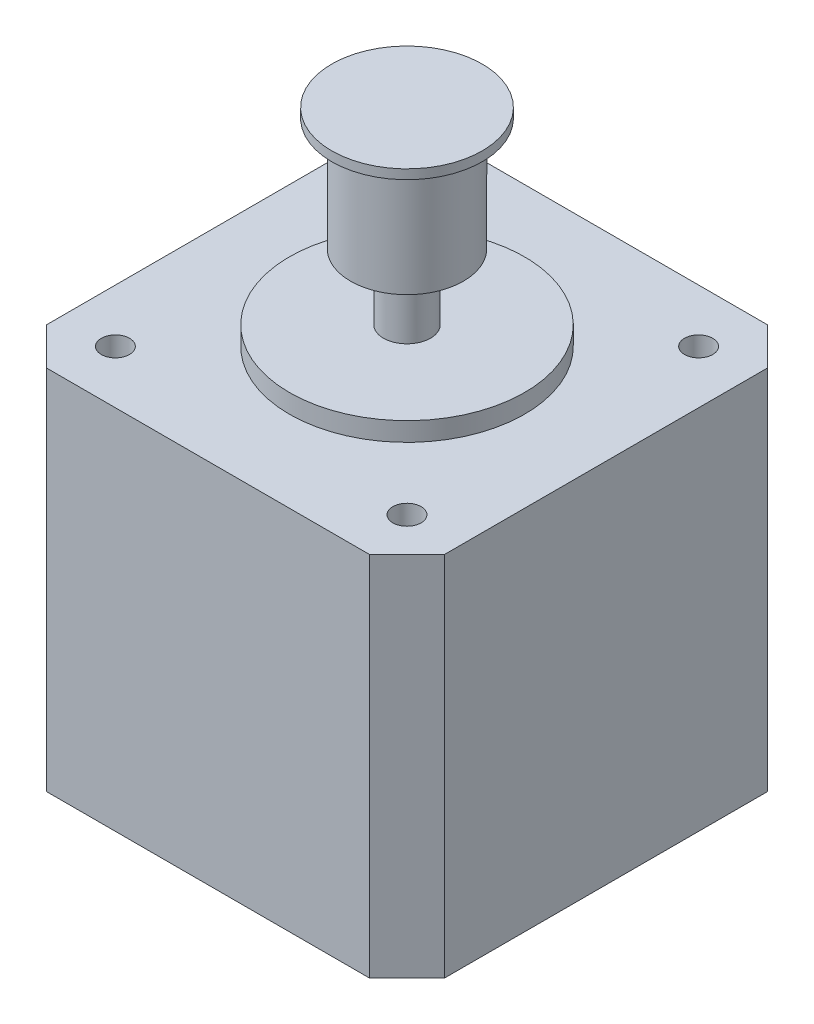
ISO-10303-21;
HEADER;
FILE_DESCRIPTION(('STEP AP214'),'2;1');
FILE_NAME('part.step','',(''),(''),'','','');
FILE_SCHEMA(('AUTOMOTIVE_DESIGN { 1 0 10303 214 1 1 1 1 }'));
ENDSEC;
DATA;
#1=APPLICATION_CONTEXT('core data for automotive mechanical design processes');
#2=APPLICATION_PROTOCOL_DEFINITION('international standard','automotive_design',2000,#1);
#3=PRODUCT_CONTEXT('',#1,'mechanical');
#4=PRODUCT('Part','Part','',(#3));
#5=PRODUCT_RELATED_PRODUCT_CATEGORY('part','',(#4));
#6=PRODUCT_DEFINITION_FORMATION('','',#4);
#7=PRODUCT_DEFINITION_CONTEXT('part definition',#1,'design');
#8=PRODUCT_DEFINITION('design','',#6,#7);
#9=PRODUCT_DEFINITION_SHAPE('','',#8);
#10=(LENGTH_UNIT() NAMED_UNIT(*) SI_UNIT(.MILLI.,.METRE.));
#11=(NAMED_UNIT(*) PLANE_ANGLE_UNIT() SI_UNIT($,.RADIAN.));
#12=(NAMED_UNIT(*) SI_UNIT($,.STERADIAN.) SOLID_ANGLE_UNIT());
#13=UNCERTAINTY_MEASURE_WITH_UNIT(LENGTH_MEASURE(1.E-05),#10,'distance_accuracy_value','');
#14=(GEOMETRIC_REPRESENTATION_CONTEXT(3) GLOBAL_UNCERTAINTY_ASSIGNED_CONTEXT((#13)) GLOBAL_UNIT_ASSIGNED_CONTEXT((#10,
#11,#12)) REPRESENTATION_CONTEXT('',''));
#15=CARTESIAN_POINT('',(0.,0.,0.));
#16=DIRECTION('',(0.,0.,1.));
#17=DIRECTION('',(1.,0.,0.));
#18=AXIS2_PLACEMENT_3D('',#15,#16,#17);
#19=CARTESIAN_POINT('',(0.,41.5,0.));
#20=DIRECTION('',(0.,-1.,0.));
#21=DIRECTION('',(0.,0.,-1.));
#22=AXIS2_PLACEMENT_3D('',#19,#20,#21);
#23=CYLINDRICAL_SURFACE('',#22,2.5);
#24=CARTESIAN_POINT('',(0.,28.5,0.));
#25=DIRECTION('',(0.,-1.,0.));
#26=DIRECTION('',(0.,0.,-1.));
#27=AXIS2_PLACEMENT_3D('',#24,#25,#26);
#28=CIRCLE('',#27,2.5);
#29=CARTESIAN_POINT('',(0.,28.5,-2.5));
#30=VERTEX_POINT('',#29);
#31=EDGE_CURVE('E141',#30,#30,#28,.T.);
#32=ORIENTED_EDGE('',*,*,#31,.T.);
#33=EDGE_LOOP('',(#32));
#34=FACE_BOUND('',#33,.T.);
#35=CARTESIAN_POINT('',(0.,21.5,0.));
#36=DIRECTION('',(0.,1.,0.));
#37=DIRECTION('',(0.,0.,1.));
#38=AXIS2_PLACEMENT_3D('',#35,#36,#37);
#39=CIRCLE('',#38,2.5);
#40=CARTESIAN_POINT('',(0.,21.5,2.5));
#41=VERTEX_POINT('',#40);
#42=EDGE_CURVE('E140',#41,#41,#39,.T.);
#43=ORIENTED_EDGE('',*,*,#42,.T.);
#44=EDGE_LOOP('',(#43));
#45=FACE_BOUND('',#44,.T.);
#46=ADVANCED_FACE('F36',(#34,#45),#23,.T.);
#47=CARTESIAN_POINT('',(0.,19.5,0.));
#48=DIRECTION('',(0.,1.,0.));
#49=DIRECTION('',(0.,0.,1.));
#50=AXIS2_PLACEMENT_3D('',#47,#48,#49);
#51=PLANE('',#50);
#52=CARTESIAN_POINT('',(0.,19.5,0.));
#53=DIRECTION('',(0.,1.,0.));
#54=DIRECTION('',(0.,0.,1.));
#55=AXIS2_PLACEMENT_3D('',#52,#53,#54);
#56=CIRCLE('',#55,12.5);
#57=CARTESIAN_POINT('',(0.,19.5,12.5));
#58=VERTEX_POINT('',#57);
#59=EDGE_CURVE('E204',#58,#58,#56,.T.);
#60=ORIENTED_EDGE('',*,*,#59,.F.);
#61=EDGE_LOOP('',(#60));
#62=FACE_BOUND('',#61,.T.);
#63=CARTESIAN_POINT('',(-15.5,19.5,15.5));
#64=DIRECTION('',(0.,1.,0.));
#65=DIRECTION('',(0.,0.,1.));
#66=AXIS2_PLACEMENT_3D('',#63,#64,#65);
#67=CIRCLE('',#66,1.5);
#68=CARTESIAN_POINT('',(-15.5,19.5,17.));
#69=VERTEX_POINT('',#68);
#70=EDGE_CURVE('E189',#69,#69,#67,.T.);
#71=ORIENTED_EDGE('',*,*,#70,.F.);
#72=EDGE_LOOP('',(#71));
#73=FACE_BOUND('',#72,.T.);
#74=CARTESIAN_POINT('',(15.5,19.5,-15.5));
#75=DIRECTION('',(0.,1.,0.));
#76=DIRECTION('',(0.,0.,1.));
#77=AXIS2_PLACEMENT_3D('',#74,#75,#76);
#78=CIRCLE('',#77,1.5);
#79=CARTESIAN_POINT('',(15.5,19.5,-14.));
#80=VERTEX_POINT('',#79);
#81=EDGE_CURVE('E172',#80,#80,#78,.T.);
#82=ORIENTED_EDGE('',*,*,#81,.F.);
#83=EDGE_LOOP('',(#82));
#84=FACE_BOUND('',#83,.T.);
#85=DIRECTION('',(0.,0.,1.));
#86=VECTOR('',#85,1.);
#87=CARTESIAN_POINT('',(-21.15,19.5,-21.15));
#88=LINE('',#87,#86);
#89=CARTESIAN_POINT('',(-21.15,19.5,-17.15));
#90=VERTEX_POINT('',#89);
#91=CARTESIAN_POINT('',(-21.15,19.5,17.15));
#92=VERTEX_POINT('',#91);
#93=EDGE_CURVE('E176',#90,#92,#88,.T.);
#94=ORIENTED_EDGE('',*,*,#93,.T.);
#95=DIRECTION('',(-0.707106781186546,0.,-0.707106781186549));
#96=VECTOR('',#95,1.);
#97=CARTESIAN_POINT('',(-19.15,19.5,19.15));
#98=LINE('',#97,#96);
#99=CARTESIAN_POINT('',(-17.15,19.5,21.15));
#100=VERTEX_POINT('',#99);
#101=EDGE_CURVE('E159',#92,#100,#98,.F.);
#102=ORIENTED_EDGE('',*,*,#101,.T.);
#103=DIRECTION('',(1.,0.,0.));
#104=VECTOR('',#103,1.);
#105=CARTESIAN_POINT('',(-21.15,19.5,21.15));
#106=LINE('',#105,#104);
#107=CARTESIAN_POINT('',(17.15,19.5,21.15));
#108=VERTEX_POINT('',#107);
#109=EDGE_CURVE('E121',#100,#108,#106,.T.);
#110=ORIENTED_EDGE('',*,*,#109,.T.);
#111=DIRECTION('',(-0.707106781186549,0.,0.707106781186546));
#112=VECTOR('',#111,1.);
#113=CARTESIAN_POINT('',(19.15,19.5,19.15));
#114=LINE('',#113,#112);
#115=CARTESIAN_POINT('',(21.15,19.5,17.15));
#116=VERTEX_POINT('',#115);
#117=EDGE_CURVE('E157',#108,#116,#114,.F.);
#118=ORIENTED_EDGE('',*,*,#117,.T.);
#119=DIRECTION('',(0.,0.,-1.));
#120=VECTOR('',#119,1.);
#121=CARTESIAN_POINT('',(21.15,19.5,-21.15));
#122=LINE('',#121,#120);
#123=CARTESIAN_POINT('',(21.15,19.5,-17.15));
#124=VERTEX_POINT('',#123);
#125=EDGE_CURVE('E128',#116,#124,#122,.T.);
#126=ORIENTED_EDGE('',*,*,#125,.T.);
#127=DIRECTION('',(0.707106781186546,0.,0.707106781186549));
#128=VECTOR('',#127,1.);
#129=CARTESIAN_POINT('',(19.15,19.5,-19.15));
#130=LINE('',#129,#128);
#131=CARTESIAN_POINT('',(17.15,19.5,-21.15));
#132=VERTEX_POINT('',#131);
#133=EDGE_CURVE('E56',#124,#132,#130,.F.);
#134=ORIENTED_EDGE('',*,*,#133,.T.);
#135=DIRECTION('',(-1.,0.,0.));
#136=VECTOR('',#135,1.);
#137=CARTESIAN_POINT('',(-21.15,19.5,-21.15));
#138=LINE('',#137,#136);
#139=CARTESIAN_POINT('',(-17.15,19.5,-21.15));
#140=VERTEX_POINT('',#139);
#141=EDGE_CURVE('E131',#132,#140,#138,.T.);
#142=ORIENTED_EDGE('',*,*,#141,.T.);
#143=DIRECTION('',(0.707106781186549,0.,-0.707106781186546));
#144=VECTOR('',#143,1.);
#145=CARTESIAN_POINT('',(-19.15,19.5,-19.15));
#146=LINE('',#145,#144);
#147=EDGE_CURVE('E155',#140,#90,#146,.F.);
#148=ORIENTED_EDGE('',*,*,#147,.T.);
#149=EDGE_LOOP('',(#94,#102,#110,#118,#126,#134,#142,#148));
#150=FACE_BOUND('',#149,.T.);
#151=CARTESIAN_POINT('',(15.5,19.5,15.5));
#152=DIRECTION('',(0.,1.,0.));
#153=DIRECTION('',(0.,0.,-1.));
#154=AXIS2_PLACEMENT_3D('',#151,#152,#153);
#155=CIRCLE('',#154,1.5);
#156=CARTESIAN_POINT('',(15.5,19.5,14.));
#157=VERTEX_POINT('',#156);
#158=EDGE_CURVE('E183',#157,#157,#155,.T.);
#159=ORIENTED_EDGE('',*,*,#158,.F.);
#160=EDGE_LOOP('',(#159));
#161=FACE_BOUND('',#160,.T.);
#162=CARTESIAN_POINT('',(-15.5,19.5,-15.5));
#163=DIRECTION('',(0.,1.,0.));
#164=DIRECTION('',(0.,0.,-1.));
#165=AXIS2_PLACEMENT_3D('',#162,#163,#164);
#166=CIRCLE('',#165,1.5);
#167=CARTESIAN_POINT('',(-15.5,19.5,-17.));
#168=VERTEX_POINT('',#167);
#169=EDGE_CURVE('E195',#168,#168,#166,.T.);
#170=ORIENTED_EDGE('',*,*,#169,.F.);
#171=EDGE_LOOP('',(#170));
#172=FACE_BOUND('',#171,.T.);
#173=ADVANCED_FACE('F250',(#62,#73,#84,#150,#161,#172),#51,.T.);
#174=CARTESIAN_POINT('',(0.,-19.5,0.));
#175=DIRECTION('',(0.,1.,0.));
#176=DIRECTION('',(0.,0.,1.));
#177=AXIS2_PLACEMENT_3D('',#174,#175,#176);
#178=PLANE('',#177);
#179=DIRECTION('',(1.,0.,0.));
#180=VECTOR('',#179,1.);
#181=CARTESIAN_POINT('',(-21.15,-19.5,21.15));
#182=LINE('',#181,#180);
#183=CARTESIAN_POINT('',(-17.15,-19.5,21.15));
#184=VERTEX_POINT('',#183);
#185=CARTESIAN_POINT('',(17.15,-19.5,21.15));
#186=VERTEX_POINT('',#185);
#187=EDGE_CURVE('E118',#184,#186,#182,.T.);
#188=ORIENTED_EDGE('',*,*,#187,.F.);
#189=DIRECTION('',(0.707106781186546,0.,0.707106781186549));
#190=VECTOR('',#189,1.);
#191=CARTESIAN_POINT('',(-17.15,-19.5,21.15));
#192=LINE('',#191,#190);
#193=CARTESIAN_POINT('',(-21.15,-19.5,17.15));
#194=VERTEX_POINT('',#193);
#195=EDGE_CURVE('E101',#184,#194,#192,.F.);
#196=ORIENTED_EDGE('',*,*,#195,.T.);
#197=DIRECTION('',(0.,0.,1.));
#198=VECTOR('',#197,1.);
#199=CARTESIAN_POINT('',(-21.15,-19.5,-21.15));
#200=LINE('',#199,#198);
#201=CARTESIAN_POINT('',(-21.15,-19.5,-17.15));
#202=VERTEX_POINT('',#201);
#203=EDGE_CURVE('E129',#202,#194,#200,.T.);
#204=ORIENTED_EDGE('',*,*,#203,.F.);
#205=DIRECTION('',(-0.707106781186549,0.,0.707106781186546));
#206=VECTOR('',#205,1.);
#207=CARTESIAN_POINT('',(-21.15,-19.5,-17.15));
#208=LINE('',#207,#206);
#209=CARTESIAN_POINT('',(-17.15,-19.5,-21.15));
#210=VERTEX_POINT('',#209);
#211=EDGE_CURVE('E148',#202,#210,#208,.F.);
#212=ORIENTED_EDGE('',*,*,#211,.T.);
#213=DIRECTION('',(-1.,0.,0.));
#214=VECTOR('',#213,1.);
#215=CARTESIAN_POINT('',(-21.15,-19.5,-21.15));
#216=LINE('',#215,#214);
#217=CARTESIAN_POINT('',(17.15,-19.5,-21.15));
#218=VERTEX_POINT('',#217);
#219=EDGE_CURVE('E133',#218,#210,#216,.T.);
#220=ORIENTED_EDGE('',*,*,#219,.F.);
#221=DIRECTION('',(-0.707106781186546,0.,-0.707106781186549));
#222=VECTOR('',#221,1.);
#223=CARTESIAN_POINT('',(17.15,-19.5,-21.15));
#224=LINE('',#223,#222);
#225=CARTESIAN_POINT('',(21.15,-19.5,-17.15));
#226=VERTEX_POINT('',#225);
#227=EDGE_CURVE('E122',#218,#226,#224,.F.);
#228=ORIENTED_EDGE('',*,*,#227,.T.);
#229=DIRECTION('',(0.,0.,-1.));
#230=VECTOR('',#229,1.);
#231=CARTESIAN_POINT('',(21.15,-19.5,-21.15));
#232=LINE('',#231,#230);
#233=CARTESIAN_POINT('',(21.15,-19.5,17.15));
#234=VERTEX_POINT('',#233);
#235=EDGE_CURVE('E171',#234,#226,#232,.T.);
#236=ORIENTED_EDGE('',*,*,#235,.F.);
#237=DIRECTION('',(0.707106781186549,0.,-0.707106781186546));
#238=VECTOR('',#237,1.);
#239=CARTESIAN_POINT('',(21.15,-19.5,17.15));
#240=LINE('',#239,#238);
#241=EDGE_CURVE('E112',#234,#186,#240,.F.);
#242=ORIENTED_EDGE('',*,*,#241,.T.);
#243=EDGE_LOOP('',(#188,#196,#204,#212,#220,#228,#236,#242));
#244=FACE_BOUND('',#243,.T.);
#245=CARTESIAN_POINT('',(15.5,-19.5,-15.5));
#246=DIRECTION('',(0.,1.,0.));
#247=DIRECTION('',(0.,0.,1.));
#248=AXIS2_PLACEMENT_3D('',#245,#246,#247);
#249=CIRCLE('',#248,1.5);
#250=CARTESIAN_POINT('',(15.5,-19.5,-14.));
#251=VERTEX_POINT('',#250);
#252=EDGE_CURVE('E180',#251,#251,#249,.T.);
#253=ORIENTED_EDGE('',*,*,#252,.T.);
#254=EDGE_LOOP('',(#253));
#255=FACE_BOUND('',#254,.T.);
#256=CARTESIAN_POINT('',(15.5,-19.5,15.5));
#257=DIRECTION('',(0.,1.,0.));
#258=DIRECTION('',(0.,0.,-1.));
#259=AXIS2_PLACEMENT_3D('',#256,#257,#258);
#260=CIRCLE('',#259,1.5);
#261=CARTESIAN_POINT('',(15.5,-19.5,14.));
#262=VERTEX_POINT('',#261);
#263=EDGE_CURVE('E186',#262,#262,#260,.T.);
#264=ORIENTED_EDGE('',*,*,#263,.T.);
#265=EDGE_LOOP('',(#264));
#266=FACE_BOUND('',#265,.T.);
#267=CARTESIAN_POINT('',(-15.5,-19.5,15.5));
#268=DIRECTION('',(0.,1.,0.));
#269=DIRECTION('',(0.,0.,1.));
#270=AXIS2_PLACEMENT_3D('',#267,#268,#269);
#271=CIRCLE('',#270,1.5);
#272=CARTESIAN_POINT('',(-15.5,-19.5,17.));
#273=VERTEX_POINT('',#272);
#274=EDGE_CURVE('E192',#273,#273,#271,.T.);
#275=ORIENTED_EDGE('',*,*,#274,.T.);
#276=EDGE_LOOP('',(#275));
#277=FACE_BOUND('',#276,.T.);
#278=CARTESIAN_POINT('',(-15.5,-19.5,-15.5));
#279=DIRECTION('',(0.,1.,0.));
#280=DIRECTION('',(0.,0.,-1.));
#281=AXIS2_PLACEMENT_3D('',#278,#279,#280);
#282=CIRCLE('',#281,1.5);
#283=CARTESIAN_POINT('',(-15.5,-19.5,-17.));
#284=VERTEX_POINT('',#283);
#285=EDGE_CURVE('E198',#284,#284,#282,.T.);
#286=ORIENTED_EDGE('',*,*,#285,.T.);
#287=EDGE_LOOP('',(#286));
#288=FACE_BOUND('',#287,.T.);
#289=ADVANCED_FACE('F125',(#244,#255,#266,#277,#288),#178,.F.);
#290=CARTESIAN_POINT('',(21.15,19.5,-21.15));
#291=DIRECTION('',(-1.,0.,0.));
#292=DIRECTION('',(0.,0.,1.));
#293=AXIS2_PLACEMENT_3D('',#290,#291,#292);
#294=PLANE('',#293);
#295=ORIENTED_EDGE('',*,*,#125,.F.);
#296=DIRECTION('',(0.,-1.,0.));
#297=VECTOR('',#296,1.);
#298=CARTESIAN_POINT('',(21.15,19.5,17.15));
#299=LINE('',#298,#297);
#300=EDGE_CURVE('E163',#116,#234,#299,.T.);
#301=ORIENTED_EDGE('',*,*,#300,.T.);
#302=ORIENTED_EDGE('',*,*,#235,.T.);
#303=DIRECTION('',(0.,1.,0.));
#304=VECTOR('',#303,1.);
#305=CARTESIAN_POINT('',(21.15,19.5,-17.15));
#306=LINE('',#305,#304);
#307=EDGE_CURVE('E161',#226,#124,#306,.T.);
#308=ORIENTED_EDGE('',*,*,#307,.T.);
#309=EDGE_LOOP('',(#295,#301,#302,#308));
#310=FACE_BOUND('',#309,.T.);
#311=ADVANCED_FACE('F284',(#310),#294,.F.);
#312=CARTESIAN_POINT('',(-21.15,19.5,-21.15));
#313=DIRECTION('',(0.,0.,1.));
#314=DIRECTION('',(1.,0.,0.));
#315=AXIS2_PLACEMENT_3D('',#312,#313,#314);
#316=PLANE('',#315);
#317=ORIENTED_EDGE('',*,*,#219,.T.);
#318=DIRECTION('',(0.,1.,0.));
#319=VECTOR('',#318,1.);
#320=CARTESIAN_POINT('',(-17.15,19.5,-21.15));
#321=LINE('',#320,#319);
#322=EDGE_CURVE('E11',#210,#140,#321,.T.);
#323=ORIENTED_EDGE('',*,*,#322,.T.);
#324=ORIENTED_EDGE('',*,*,#141,.F.);
#325=DIRECTION('',(0.,-1.,0.));
#326=VECTOR('',#325,1.);
#327=CARTESIAN_POINT('',(17.15,19.5,-21.15));
#328=LINE('',#327,#326);
#329=EDGE_CURVE('E44',#132,#218,#328,.T.);
#330=ORIENTED_EDGE('',*,*,#329,.T.);
#331=EDGE_LOOP('',(#317,#323,#324,#330));
#332=FACE_BOUND('',#331,.T.);
#333=ADVANCED_FACE('F168',(#332),#316,.F.);
#334=CARTESIAN_POINT('',(-21.15,19.5,-21.15));
#335=DIRECTION('',(1.,0.,0.));
#336=DIRECTION('',(0.,0.,-1.));
#337=AXIS2_PLACEMENT_3D('',#334,#335,#336);
#338=PLANE('',#337);
#339=ORIENTED_EDGE('',*,*,#203,.T.);
#340=DIRECTION('',(0.,1.,0.));
#341=VECTOR('',#340,1.);
#342=CARTESIAN_POINT('',(-21.15,19.5,17.15));
#343=LINE('',#342,#341);
#344=EDGE_CURVE('E106',#194,#92,#343,.T.);
#345=ORIENTED_EDGE('',*,*,#344,.T.);
#346=ORIENTED_EDGE('',*,*,#93,.F.);
#347=DIRECTION('',(0.,-1.,0.));
#348=VECTOR('',#347,1.);
#349=CARTESIAN_POINT('',(-21.15,19.5,-17.15));
#350=LINE('',#349,#348);
#351=EDGE_CURVE('E111',#90,#202,#350,.T.);
#352=ORIENTED_EDGE('',*,*,#351,.T.);
#353=EDGE_LOOP('',(#339,#345,#346,#352));
#354=FACE_BOUND('',#353,.T.);
#355=ADVANCED_FACE('F287',(#354),#338,.F.);
#356=CARTESIAN_POINT('',(-21.15,19.5,21.15));
#357=DIRECTION('',(0.,0.,-1.));
#358=DIRECTION('',(-1.,0.,0.));
#359=AXIS2_PLACEMENT_3D('',#356,#357,#358);
#360=PLANE('',#359);
#361=ORIENTED_EDGE('',*,*,#109,.F.);
#362=DIRECTION('',(0.,-1.,0.));
#363=VECTOR('',#362,1.);
#364=CARTESIAN_POINT('',(-17.15,19.5,21.15));
#365=LINE('',#364,#363);
#366=EDGE_CURVE('E105',#100,#184,#365,.T.);
#367=ORIENTED_EDGE('',*,*,#366,.T.);
#368=ORIENTED_EDGE('',*,*,#187,.T.);
#369=DIRECTION('',(0.,1.,0.));
#370=VECTOR('',#369,1.);
#371=CARTESIAN_POINT('',(17.15,19.5,21.15));
#372=LINE('',#371,#370);
#373=EDGE_CURVE('E123',#186,#108,#372,.T.);
#374=ORIENTED_EDGE('',*,*,#373,.T.);
#375=EDGE_LOOP('',(#361,#367,#368,#374));
#376=FACE_BOUND('',#375,.T.);
#377=ADVANCED_FACE('F117',(#376),#360,.F.);
#378=CARTESIAN_POINT('',(15.5,19.5,-15.5));
#379=DIRECTION('',(0.,-1.,0.));
#380=DIRECTION('',(0.,0.,-1.));
#381=AXIS2_PLACEMENT_3D('',#378,#379,#380);
#382=CYLINDRICAL_SURFACE('',#381,1.5);
#383=ORIENTED_EDGE('',*,*,#81,.T.);
#384=EDGE_LOOP('',(#383));
#385=FACE_BOUND('',#384,.T.);
#386=ORIENTED_EDGE('',*,*,#252,.F.);
#387=EDGE_LOOP('',(#386));
#388=FACE_BOUND('',#387,.T.);
#389=ADVANCED_FACE('F277',(#385,#388),#382,.F.);
#390=CARTESIAN_POINT('',(15.5,19.5,15.5));
#391=DIRECTION('',(0.,-1.,0.));
#392=DIRECTION('',(0.,0.,-1.));
#393=AXIS2_PLACEMENT_3D('',#390,#391,#392);
#394=CYLINDRICAL_SURFACE('',#393,1.5);
#395=ORIENTED_EDGE('',*,*,#158,.T.);
#396=EDGE_LOOP('',(#395));
#397=FACE_BOUND('',#396,.T.);
#398=ORIENTED_EDGE('',*,*,#263,.F.);
#399=EDGE_LOOP('',(#398));
#400=FACE_BOUND('',#399,.T.);
#401=ADVANCED_FACE('F273',(#397,#400),#394,.F.);
#402=CARTESIAN_POINT('',(-15.5,19.5,15.5));
#403=DIRECTION('',(0.,-1.,0.));
#404=DIRECTION('',(0.,0.,-1.));
#405=AXIS2_PLACEMENT_3D('',#402,#403,#404);
#406=CYLINDRICAL_SURFACE('',#405,1.5);
#407=ORIENTED_EDGE('',*,*,#70,.T.);
#408=EDGE_LOOP('',(#407));
#409=FACE_BOUND('',#408,.T.);
#410=ORIENTED_EDGE('',*,*,#274,.F.);
#411=EDGE_LOOP('',(#410));
#412=FACE_BOUND('',#411,.T.);
#413=ADVANCED_FACE('F269',(#409,#412),#406,.F.);
#414=CARTESIAN_POINT('',(-15.5,19.5,-15.5));
#415=DIRECTION('',(0.,-1.,0.));
#416=DIRECTION('',(0.,0.,-1.));
#417=AXIS2_PLACEMENT_3D('',#414,#415,#416);
#418=CYLINDRICAL_SURFACE('',#417,1.5);
#419=ORIENTED_EDGE('',*,*,#169,.T.);
#420=EDGE_LOOP('',(#419));
#421=FACE_BOUND('',#420,.T.);
#422=ORIENTED_EDGE('',*,*,#285,.F.);
#423=EDGE_LOOP('',(#422));
#424=FACE_BOUND('',#423,.T.);
#425=ADVANCED_FACE('F265',(#421,#424),#418,.F.);
#426=CARTESIAN_POINT('',(0.,21.5,0.));
#427=DIRECTION('',(0.,-1.,0.));
#428=DIRECTION('',(0.,0.,-1.));
#429=AXIS2_PLACEMENT_3D('',#426,#427,#428);
#430=CYLINDRICAL_SURFACE('',#429,12.5);
#431=CARTESIAN_POINT('',(0.,21.5,0.));
#432=DIRECTION('',(0.,1.,0.));
#433=DIRECTION('',(0.,0.,1.));
#434=AXIS2_PLACEMENT_3D('',#431,#432,#433);
#435=CIRCLE('',#434,12.5);
#436=CARTESIAN_POINT('',(0.,21.5,12.5));
#437=VERTEX_POINT('',#436);
#438=EDGE_CURVE('E201',#437,#437,#435,.T.);
#439=ORIENTED_EDGE('',*,*,#438,.F.);
#440=EDGE_LOOP('',(#439));
#441=FACE_BOUND('',#440,.T.);
#442=ORIENTED_EDGE('',*,*,#59,.T.);
#443=EDGE_LOOP('',(#442));
#444=FACE_BOUND('',#443,.T.);
#445=ADVANCED_FACE('F261',(#441,#444),#430,.T.);
#446=CARTESIAN_POINT('',(0.,21.5,0.));
#447=DIRECTION('',(0.,1.,0.));
#448=DIRECTION('',(0.,0.,1.));
#449=AXIS2_PLACEMENT_3D('',#446,#447,#448);
#450=PLANE('',#449);
#451=ORIENTED_EDGE('',*,*,#42,.F.);
#452=EDGE_LOOP('',(#451));
#453=FACE_BOUND('',#452,.T.);
#454=ORIENTED_EDGE('',*,*,#438,.T.);
#455=EDGE_LOOP('',(#454));
#456=FACE_BOUND('',#455,.T.);
#457=ADVANCED_FACE('F224',(#453,#456),#450,.T.);
#458=CARTESIAN_POINT('',(0.,28.5,0.));
#459=DIRECTION('',(0.,1.,0.));
#460=DIRECTION('',(0.,0.,1.));
#461=AXIS2_PLACEMENT_3D('',#458,#459,#460);
#462=CYLINDRICAL_SURFACE('',#461,6.);
#463=CARTESIAN_POINT('',(0.,28.5,0.));
#464=DIRECTION('',(0.,-1.,0.));
#465=DIRECTION('',(0.,0.,-1.));
#466=AXIS2_PLACEMENT_3D('',#463,#464,#465);
#467=CIRCLE('',#466,6.);
#468=CARTESIAN_POINT('',(0.,28.5,-6.));
#469=VERTEX_POINT('',#468);
#470=EDGE_CURVE('E145',#469,#469,#467,.T.);
#471=ORIENTED_EDGE('',*,*,#470,.F.);
#472=EDGE_LOOP('',(#471));
#473=FACE_BOUND('',#472,.T.);
#474=CARTESIAN_POINT('',(0.,40.5,0.));
#475=DIRECTION('',(0.,1.,0.));
#476=DIRECTION('',(0.,0.,1.));
#477=AXIS2_PLACEMENT_3D('',#474,#475,#476);
#478=CIRCLE('',#477,6.);
#479=CARTESIAN_POINT('',(0.,40.5,6.));
#480=VERTEX_POINT('',#479);
#481=EDGE_CURVE('E137',#480,#480,#478,.F.);
#482=ORIENTED_EDGE('',*,*,#481,.T.);
#483=EDGE_LOOP('',(#482));
#484=FACE_BOUND('',#483,.T.);
#485=ADVANCED_FACE('F221',(#473,#484),#462,.T.);
#486=CARTESIAN_POINT('',(0.,28.5,0.));
#487=DIRECTION('',(0.,-1.,0.));
#488=DIRECTION('',(0.,0.,-1.));
#489=AXIS2_PLACEMENT_3D('',#486,#487,#488);
#490=PLANE('',#489);
#491=ORIENTED_EDGE('',*,*,#31,.F.);
#492=EDGE_LOOP('',(#491));
#493=FACE_BOUND('',#492,.T.);
#494=ORIENTED_EDGE('',*,*,#470,.T.);
#495=EDGE_LOOP('',(#494));
#496=FACE_BOUND('',#495,.T.);
#497=ADVANCED_FACE('F219',(#493,#496),#490,.T.);
#498=CARTESIAN_POINT('',(0.,41.5,0.));
#499=DIRECTION('',(0.,1.,0.));
#500=DIRECTION('',(0.,0.,1.));
#501=AXIS2_PLACEMENT_3D('',#498,#499,#500);
#502=PLANE('',#501);
#503=CARTESIAN_POINT('',(0.,41.5,0.));
#504=DIRECTION('',(0.,1.,0.));
#505=DIRECTION('',(0.,0.,1.));
#506=AXIS2_PLACEMENT_3D('',#503,#504,#505);
#507=CIRCLE('',#506,8.);
#508=CARTESIAN_POINT('',(0.,41.5,8.));
#509=VERTEX_POINT('',#508);
#510=EDGE_CURVE('E144',#509,#509,#507,.T.);
#511=ORIENTED_EDGE('',*,*,#510,.T.);
#512=EDGE_LOOP('',(#511));
#513=FACE_BOUND('',#512,.T.);
#514=ADVANCED_FACE('F237',(#513),#502,.T.);
#515=CARTESIAN_POINT('',(0.,40.5,0.));
#516=DIRECTION('',(0.,1.,0.));
#517=DIRECTION('',(0.,0.,1.));
#518=AXIS2_PLACEMENT_3D('',#515,#516,#517);
#519=CYLINDRICAL_SURFACE('',#518,8.);
#520=CARTESIAN_POINT('',(0.,40.5,0.));
#521=DIRECTION('',(0.,1.,0.));
#522=DIRECTION('',(0.,0.,1.));
#523=AXIS2_PLACEMENT_3D('',#520,#521,#522);
#524=CIRCLE('',#523,8.);
#525=CARTESIAN_POINT('',(0.,40.5,8.));
#526=VERTEX_POINT('',#525);
#527=EDGE_CURVE('E207',#526,#526,#524,.T.);
#528=ORIENTED_EDGE('',*,*,#527,.T.);
#529=EDGE_LOOP('',(#528));
#530=FACE_BOUND('',#529,.T.);
#531=ORIENTED_EDGE('',*,*,#510,.F.);
#532=EDGE_LOOP('',(#531));
#533=FACE_BOUND('',#532,.T.);
#534=ADVANCED_FACE('F231',(#530,#533),#519,.T.);
#535=CARTESIAN_POINT('',(0.,40.5,0.));
#536=DIRECTION('',(0.,1.,0.));
#537=DIRECTION('',(0.,0.,1.));
#538=AXIS2_PLACEMENT_3D('',#535,#536,#537);
#539=PLANE('',#538);
#540=ORIENTED_EDGE('',*,*,#481,.F.);
#541=EDGE_LOOP('',(#540));
#542=FACE_BOUND('',#541,.T.);
#543=ORIENTED_EDGE('',*,*,#527,.F.);
#544=EDGE_LOOP('',(#543));
#545=FACE_BOUND('',#544,.T.);
#546=ADVANCED_FACE('F228',(#542,#545),#539,.F.);
#547=CARTESIAN_POINT('',(-17.15,19.5,21.15));
#548=DIRECTION('',(0.707106781186549,0.,-0.707106781186546));
#549=DIRECTION('',(0.,-1.,0.));
#550=AXIS2_PLACEMENT_3D('',#547,#548,#549);
#551=PLANE('',#550);
#552=ORIENTED_EDGE('',*,*,#101,.F.);
#553=ORIENTED_EDGE('',*,*,#344,.F.);
#554=ORIENTED_EDGE('',*,*,#195,.F.);
#555=ORIENTED_EDGE('',*,*,#366,.F.);
#556=EDGE_LOOP('',(#552,#553,#554,#555));
#557=FACE_BOUND('',#556,.T.);
#558=ADVANCED_FACE('F104',(#557),#551,.F.);
#559=CARTESIAN_POINT('',(21.15,19.5,17.15));
#560=DIRECTION('',(-0.707106781186546,0.,-0.707106781186549));
#561=DIRECTION('',(0.,-1.,0.));
#562=AXIS2_PLACEMENT_3D('',#559,#560,#561);
#563=PLANE('',#562);
#564=ORIENTED_EDGE('',*,*,#117,.F.);
#565=ORIENTED_EDGE('',*,*,#373,.F.);
#566=ORIENTED_EDGE('',*,*,#241,.F.);
#567=ORIENTED_EDGE('',*,*,#300,.F.);
#568=EDGE_LOOP('',(#564,#565,#566,#567));
#569=FACE_BOUND('',#568,.T.);
#570=ADVANCED_FACE('F298',(#569),#563,.F.);
#571=CARTESIAN_POINT('',(-21.15,19.5,-17.15));
#572=DIRECTION('',(0.707106781186546,0.,0.707106781186549));
#573=DIRECTION('',(0.,-1.,0.));
#574=AXIS2_PLACEMENT_3D('',#571,#572,#573);
#575=PLANE('',#574);
#576=ORIENTED_EDGE('',*,*,#147,.F.);
#577=ORIENTED_EDGE('',*,*,#322,.F.);
#578=ORIENTED_EDGE('',*,*,#211,.F.);
#579=ORIENTED_EDGE('',*,*,#351,.F.);
#580=EDGE_LOOP('',(#576,#577,#578,#579));
#581=FACE_BOUND('',#580,.T.);
#582=ADVANCED_FACE('F300',(#581),#575,.F.);
#583=CARTESIAN_POINT('',(17.15,19.5,-21.15));
#584=DIRECTION('',(-0.707106781186549,0.,0.707106781186546));
#585=DIRECTION('',(0.,-1.,0.));
#586=AXIS2_PLACEMENT_3D('',#583,#584,#585);
#587=PLANE('',#586);
#588=ORIENTED_EDGE('',*,*,#133,.F.);
#589=ORIENTED_EDGE('',*,*,#307,.F.);
#590=ORIENTED_EDGE('',*,*,#227,.F.);
#591=ORIENTED_EDGE('',*,*,#329,.F.);
#592=EDGE_LOOP('',(#588,#589,#590,#591));
#593=FACE_BOUND('',#592,.T.);
#594=ADVANCED_FACE('F38',(#593),#587,.F.);
#595=CLOSED_SHELL('',(#46,#173,#289,#311,#333,#355,#377,#389,#401,#413,#425,#445,#457,#485,#497,
#514,#534,#546,#558,#570,#582,#594));
#596=MANIFOLD_SOLID_BREP('B2',#595);
#597=ADVANCED_BREP_SHAPE_REPRESENTATION('',(#18,#596),#14);
#598=SHAPE_DEFINITION_REPRESENTATION(#9,#597);
ENDSEC;
END-ISO-10303-21;
